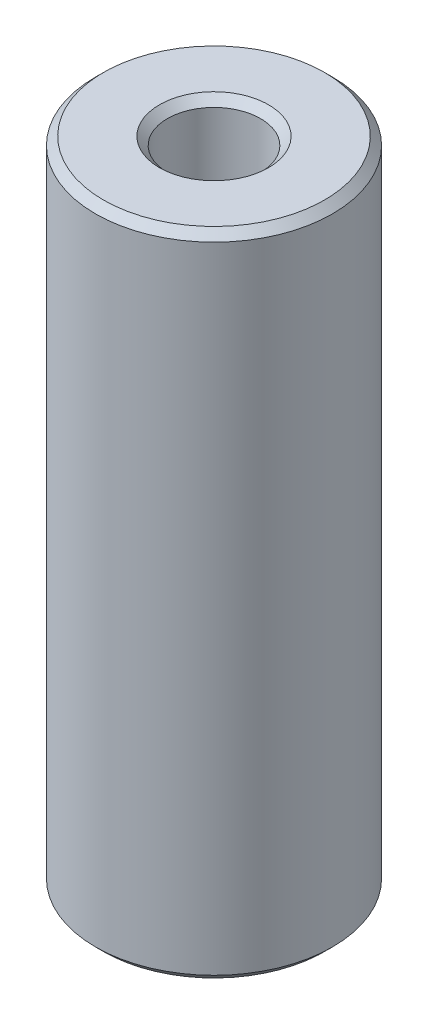
ISO-10303-21;
HEADER;
FILE_DESCRIPTION(('STEP AP214'),'2;1');
FILE_NAME('part.step','',(''),(''),'','','');
FILE_SCHEMA(('AUTOMOTIVE_DESIGN { 1 0 10303 214 1 1 1 1 }'));
ENDSEC;
DATA;
#1=APPLICATION_CONTEXT('core data for automotive mechanical design processes');
#2=APPLICATION_PROTOCOL_DEFINITION('international standard','automotive_design',2000,#1);
#3=PRODUCT_CONTEXT('',#1,'mechanical');
#4=PRODUCT('Part','Part','',(#3));
#5=PRODUCT_RELATED_PRODUCT_CATEGORY('part','',(#4));
#6=PRODUCT_DEFINITION_FORMATION('','',#4);
#7=PRODUCT_DEFINITION_CONTEXT('part definition',#1,'design');
#8=PRODUCT_DEFINITION('design','',#6,#7);
#9=PRODUCT_DEFINITION_SHAPE('','',#8);
#10=(LENGTH_UNIT() NAMED_UNIT(*) SI_UNIT(.MILLI.,.METRE.));
#11=(NAMED_UNIT(*) PLANE_ANGLE_UNIT() SI_UNIT($,.RADIAN.));
#12=(NAMED_UNIT(*) SI_UNIT($,.STERADIAN.) SOLID_ANGLE_UNIT());
#13=UNCERTAINTY_MEASURE_WITH_UNIT(LENGTH_MEASURE(1.E-05),#10,'distance_accuracy_value','');
#14=(GEOMETRIC_REPRESENTATION_CONTEXT(3) GLOBAL_UNCERTAINTY_ASSIGNED_CONTEXT((#13)) GLOBAL_UNIT_ASSIGNED_CONTEXT((#10,
#11,#12)) REPRESENTATION_CONTEXT('',''));
#15=CARTESIAN_POINT('',(0.,0.,0.));
#16=DIRECTION('',(0.,0.,1.));
#17=DIRECTION('',(1.,0.,0.));
#18=AXIS2_PLACEMENT_3D('',#15,#16,#17);
#19=CARTESIAN_POINT('',(0.,274.598627486581,0.));
#20=DIRECTION('',(0.,-1.,0.));
#21=DIRECTION('',(0.,0.,-1.));
#22=AXIS2_PLACEMENT_3D('',#19,#20,#21);
#23=CYLINDRICAL_SURFACE('',#22,50.);
#24=CARTESIAN_POINT('',(0.,3.36410920424962,0.));
#25=DIRECTION('',(0.,1.,0.));
#26=DIRECTION('',(0.,0.,1.));
#27=AXIS2_PLACEMENT_3D('',#24,#25,#26);
#28=CIRCLE('',#27,50.);
#29=CARTESIAN_POINT('',(0.,3.36410920424962,50.));
#30=VERTEX_POINT('',#29);
#31=EDGE_CURVE('E10',#30,#30,#28,.T.);
#32=ORIENTED_EDGE('',*,*,#31,.T.);
#33=EDGE_LOOP('',(#32));
#34=FACE_BOUND('',#33,.T.);
#35=CARTESIAN_POINT('',(0.,271.234518282331,0.));
#36=DIRECTION('',(0.,1.,0.));
#37=DIRECTION('',(0.,0.,1.));
#38=AXIS2_PLACEMENT_3D('',#35,#36,#37);
#39=CIRCLE('',#38,50.);
#40=CARTESIAN_POINT('',(0.,271.234518282331,50.));
#41=VERTEX_POINT('',#40);
#42=EDGE_CURVE('E50',#41,#41,#39,.F.);
#43=ORIENTED_EDGE('',*,*,#42,.T.);
#44=EDGE_LOOP('',(#43));
#45=FACE_BOUND('',#44,.T.);
#46=ADVANCED_FACE('F39',(#34,#45),#23,.T.);
#47=CARTESIAN_POINT('',(0.,274.598627486581,0.));
#48=DIRECTION('',(0.,1.,0.));
#49=DIRECTION('',(0.,0.,1.));
#50=AXIS2_PLACEMENT_3D('',#47,#48,#49);
#51=PLANE('',#50);
#52=CARTESIAN_POINT('',(0.,274.598627486581,0.));
#53=DIRECTION('',(0.,1.,0.));
#54=DIRECTION('',(0.,0.,1.));
#55=AXIS2_PLACEMENT_3D('',#52,#53,#54);
#56=CIRCLE('',#55,23.0119033348886);
#57=CARTESIAN_POINT('',(0.,274.598627486581,23.0119033348886));
#58=VERTEX_POINT('',#57);
#59=EDGE_CURVE('E58',#58,#58,#56,.F.);
#60=ORIENTED_EDGE('',*,*,#59,.T.);
#61=EDGE_LOOP('',(#60));
#62=FACE_BOUND('',#61,.T.);
#63=CARTESIAN_POINT('',(0.,274.598627486581,0.));
#64=DIRECTION('',(0.,1.,0.));
#65=DIRECTION('',(0.,0.,1.));
#66=AXIS2_PLACEMENT_3D('',#63,#64,#65);
#67=CIRCLE('',#66,46.6358907957503);
#68=CARTESIAN_POINT('',(0.,274.598627486581,46.6358907957503));
#69=VERTEX_POINT('',#68);
#70=EDGE_CURVE('E61',#69,#69,#67,.T.);
#71=ORIENTED_EDGE('',*,*,#70,.T.);
#72=EDGE_LOOP('',(#71));
#73=FACE_BOUND('',#72,.T.);
#74=ADVANCED_FACE('F88',(#62,#73),#51,.T.);
#75=CARTESIAN_POINT('',(0.,0.,0.));
#76=DIRECTION('',(0.,1.,0.));
#77=DIRECTION('',(0.,0.,1.));
#78=AXIS2_PLACEMENT_3D('',#75,#76,#77);
#79=PLANE('',#78);
#80=CARTESIAN_POINT('',(0.,0.,0.));
#81=DIRECTION('',(0.,1.,0.));
#82=DIRECTION('',(0.,0.,1.));
#83=AXIS2_PLACEMENT_3D('',#80,#81,#82);
#84=CIRCLE('',#83,23.0119033348886);
#85=CARTESIAN_POINT('',(0.,0.,23.0119033348886));
#86=VERTEX_POINT('',#85);
#87=EDGE_CURVE('E51',#86,#86,#84,.T.);
#88=ORIENTED_EDGE('',*,*,#87,.T.);
#89=EDGE_LOOP('',(#88));
#90=FACE_BOUND('',#89,.T.);
#91=CARTESIAN_POINT('',(0.,0.,0.));
#92=DIRECTION('',(0.,1.,0.));
#93=DIRECTION('',(0.,0.,1.));
#94=AXIS2_PLACEMENT_3D('',#91,#92,#93);
#95=CIRCLE('',#94,46.6358907957504);
#96=CARTESIAN_POINT('',(0.,0.,46.6358907957504));
#97=VERTEX_POINT('',#96);
#98=EDGE_CURVE('E54',#97,#97,#95,.F.);
#99=ORIENTED_EDGE('',*,*,#98,.T.);
#100=EDGE_LOOP('',(#99));
#101=FACE_BOUND('',#100,.T.);
#102=ADVANCED_FACE('F83',(#90,#101),#79,.F.);
#103=CARTESIAN_POINT('',(0.,274.598627486581,0.));
#104=DIRECTION('',(0.,-1.,0.));
#105=DIRECTION('',(0.,0.,-1.));
#106=AXIS2_PLACEMENT_3D('',#103,#104,#105);
#107=CYLINDRICAL_SURFACE('',#106,19.647794130639);
#108=CARTESIAN_POINT('',(0.,271.234518282331,0.));
#109=DIRECTION('',(0.,1.,0.));
#110=DIRECTION('',(0.,0.,1.));
#111=AXIS2_PLACEMENT_3D('',#108,#109,#110);
#112=CIRCLE('',#111,19.647794130639);
#113=CARTESIAN_POINT('',(0.,271.234518282331,19.647794130639));
#114=VERTEX_POINT('',#113);
#115=EDGE_CURVE('E67',#114,#114,#112,.T.);
#116=ORIENTED_EDGE('',*,*,#115,.T.);
#117=EDGE_LOOP('',(#116));
#118=FACE_BOUND('',#117,.T.);
#119=CARTESIAN_POINT('',(0.,3.36410920424968,0.));
#120=DIRECTION('',(0.,1.,0.));
#121=DIRECTION('',(0.,0.,1.));
#122=AXIS2_PLACEMENT_3D('',#119,#120,#121);
#123=CIRCLE('',#122,19.647794130639);
#124=CARTESIAN_POINT('',(0.,3.36410920424968,19.647794130639));
#125=VERTEX_POINT('',#124);
#126=EDGE_CURVE('E69',#125,#125,#123,.F.);
#127=ORIENTED_EDGE('',*,*,#126,.T.);
#128=EDGE_LOOP('',(#127));
#129=FACE_BOUND('',#128,.T.);
#130=ADVANCED_FACE('F71',(#118,#129),#107,.F.);
#131=CARTESIAN_POINT('',(0.,271.234518282331,0.));
#132=DIRECTION('',(0.,1.,0.));
#133=DIRECTION('',(0.,0.,1.));
#134=AXIS2_PLACEMENT_3D('',#131,#132,#133);
#135=CONICAL_SURFACE('',#134,19.647794130639,0.785398163397452);
#136=ORIENTED_EDGE('',*,*,#59,.F.);
#137=EDGE_LOOP('',(#136));
#138=FACE_BOUND('',#137,.T.);
#139=ORIENTED_EDGE('',*,*,#115,.F.);
#140=EDGE_LOOP('',(#139));
#141=FACE_BOUND('',#140,.T.);
#142=ADVANCED_FACE('F77',(#138,#141),#135,.F.);
#143=CARTESIAN_POINT('',(0.,0.,0.));
#144=DIRECTION('',(0.,-1.,0.));
#145=DIRECTION('',(0.,0.,-1.));
#146=AXIS2_PLACEMENT_3D('',#143,#144,#145);
#147=CONICAL_SURFACE('',#146,23.0119033348886,0.78539816339744);
#148=ORIENTED_EDGE('',*,*,#126,.F.);
#149=EDGE_LOOP('',(#148));
#150=FACE_BOUND('',#149,.T.);
#151=ORIENTED_EDGE('',*,*,#87,.F.);
#152=EDGE_LOOP('',(#151));
#153=FACE_BOUND('',#152,.T.);
#154=ADVANCED_FACE('F73',(#150,#153),#147,.F.);
#155=CARTESIAN_POINT('',(0.,3.36410920424962,0.));
#156=DIRECTION('',(0.,1.,0.));
#157=DIRECTION('',(0.,0.,1.));
#158=AXIS2_PLACEMENT_3D('',#155,#156,#157);
#159=CONICAL_SURFACE('',#158,50.,0.785398163397449);
#160=ORIENTED_EDGE('',*,*,#98,.F.);
#161=EDGE_LOOP('',(#160));
#162=FACE_BOUND('',#161,.T.);
#163=ORIENTED_EDGE('',*,*,#31,.F.);
#164=EDGE_LOOP('',(#163));
#165=FACE_BOUND('',#164,.T.);
#166=ADVANCED_FACE('F76',(#162,#165),#159,.T.);
#167=CARTESIAN_POINT('',(0.,274.598627486581,0.));
#168=DIRECTION('',(0.,-1.,0.));
#169=DIRECTION('',(0.,0.,-1.));
#170=AXIS2_PLACEMENT_3D('',#167,#168,#169);
#171=CONICAL_SURFACE('',#170,46.6358907957503,0.785398163397438);
#172=ORIENTED_EDGE('',*,*,#42,.F.);
#173=EDGE_LOOP('',(#172));
#174=FACE_BOUND('',#173,.T.);
#175=ORIENTED_EDGE('',*,*,#70,.F.);
#176=EDGE_LOOP('',(#175));
#177=FACE_BOUND('',#176,.T.);
#178=ADVANCED_FACE('F45',(#174,#177),#171,.T.);
#179=CLOSED_SHELL('',(#46,#74,#102,#130,#142,#154,#166,#178));
#180=MANIFOLD_SOLID_BREP('B2',#179);
#181=ADVANCED_BREP_SHAPE_REPRESENTATION('',(#18,#180),#14);
#182=SHAPE_DEFINITION_REPRESENTATION(#9,#181);
ENDSEC;
END-ISO-10303-21;
